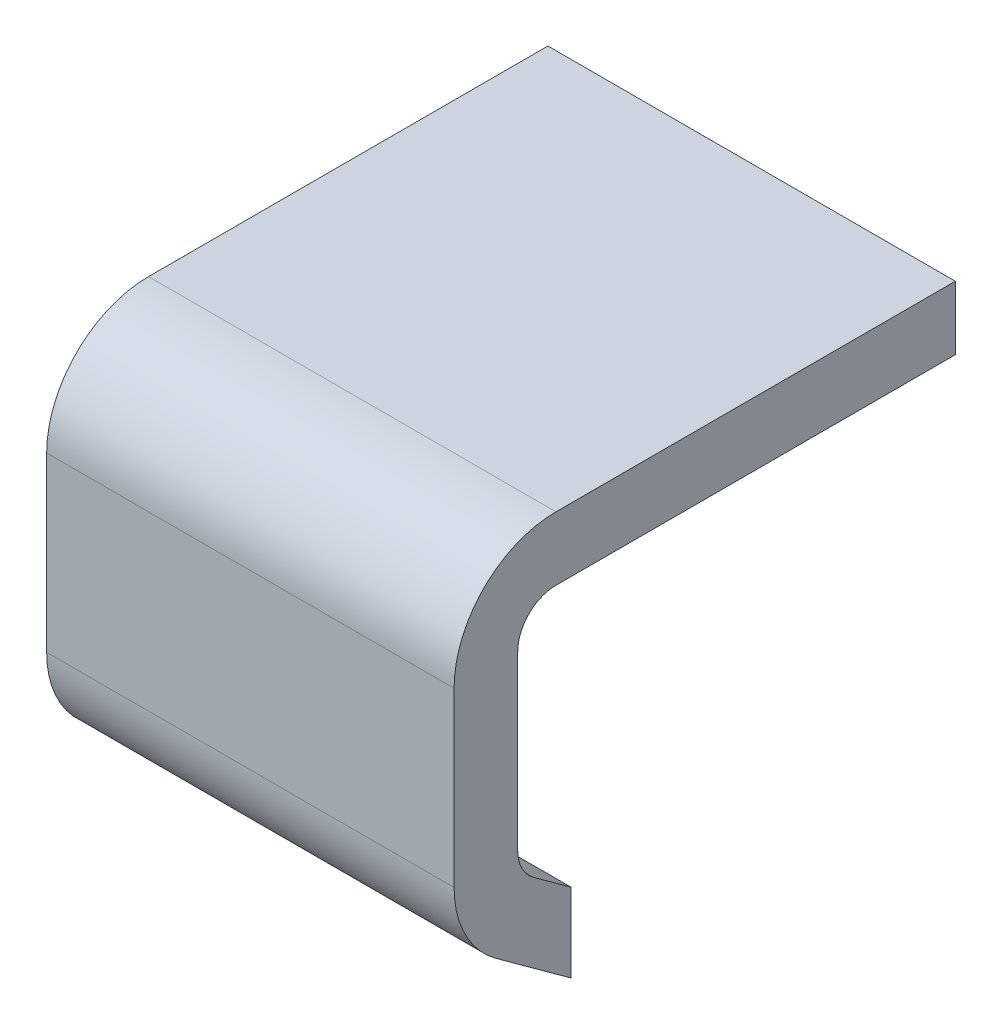
ISO-10303-21;
HEADER;
FILE_DESCRIPTION(('STEP AP214'),'2;1');
FILE_NAME('part.step','',(''),(''),'','','');
FILE_SCHEMA(('AUTOMOTIVE_DESIGN { 1 0 10303 214 1 1 1 1 }'));
ENDSEC;
DATA;
#1=APPLICATION_CONTEXT('core data for automotive mechanical design processes');
#2=APPLICATION_PROTOCOL_DEFINITION('international standard','automotive_design',2000,#1);
#3=PRODUCT_CONTEXT('',#1,'mechanical');
#4=PRODUCT('Part','Part','',(#3));
#5=PRODUCT_RELATED_PRODUCT_CATEGORY('part','',(#4));
#6=PRODUCT_DEFINITION_FORMATION('','',#4);
#7=PRODUCT_DEFINITION_CONTEXT('part definition',#1,'design');
#8=PRODUCT_DEFINITION('design','',#6,#7);
#9=PRODUCT_DEFINITION_SHAPE('','',#8);
#10=(LENGTH_UNIT() NAMED_UNIT(*) SI_UNIT(.MILLI.,.METRE.));
#11=(NAMED_UNIT(*) PLANE_ANGLE_UNIT() SI_UNIT($,.RADIAN.));
#12=(NAMED_UNIT(*) SI_UNIT($,.STERADIAN.) SOLID_ANGLE_UNIT());
#13=UNCERTAINTY_MEASURE_WITH_UNIT(LENGTH_MEASURE(1.E-05),#10,'distance_accuracy_value','');
#14=(GEOMETRIC_REPRESENTATION_CONTEXT(3) GLOBAL_UNCERTAINTY_ASSIGNED_CONTEXT((#13)) GLOBAL_UNIT_ASSIGNED_CONTEXT((#10,
#11,#12)) REPRESENTATION_CONTEXT('',''));
#15=CARTESIAN_POINT('',(0.,0.,0.));
#16=DIRECTION('',(0.,0.,1.));
#17=DIRECTION('',(1.,0.,0.));
#18=AXIS2_PLACEMENT_3D('',#15,#16,#17);
#19=CARTESIAN_POINT('',(0.9652,2.62187788786696,0.20779852546605));
#20=DIRECTION('',(0.,0.,1.));
#21=DIRECTION('',(1.,0.,0.));
#22=AXIS2_PLACEMENT_3D('',#19,#20,#21);
#23=PLANE('',#22);
#24=DIRECTION('',(0.,1.,0.));
#25=VECTOR('',#24,1.);
#26=CARTESIAN_POINT('',(1.3716,2.9337,0.20779852546605));
#27=LINE('',#26,#25);
#28=CARTESIAN_POINT('',(1.3716,2.794,0.207798525466051));
#29=VERTEX_POINT('',#28);
#30=CARTESIAN_POINT('',(1.3716,2.44975577573621,0.207798525466051));
#31=VERTEX_POINT('',#30);
#32=EDGE_CURVE('E185',#29,#31,#27,.F.);
#33=ORIENTED_EDGE('',*,*,#32,.F.);
#34=DIRECTION('',(1.,0.,0.));
#35=VECTOR('',#34,1.);
#36=CARTESIAN_POINT('',(1.39554278568583,2.794,0.207798525466052));
#37=LINE('',#36,#35);
#38=CARTESIAN_POINT('',(0.5588,2.794,0.207798525466051));
#39=VERTEX_POINT('',#38);
#40=EDGE_CURVE('E170',#39,#29,#37,.T.);
#41=ORIENTED_EDGE('',*,*,#40,.F.);
#42=DIRECTION('',(0.,1.,0.));
#43=VECTOR('',#42,1.);
#44=CARTESIAN_POINT('',(0.5588,2.9337,0.20779852546605));
#45=LINE('',#44,#43);
#46=CARTESIAN_POINT('',(0.5588,2.44975577573621,0.207798525466051));
#47=VERTEX_POINT('',#46);
#48=EDGE_CURVE('E101',#39,#47,#45,.F.);
#49=ORIENTED_EDGE('',*,*,#48,.T.);
#50=DIRECTION('',(1.,0.,0.));
#51=VECTOR('',#50,1.);
#52=CARTESIAN_POINT('',(1.39554278568583,2.44975577573621,0.207798525466052));
#53=LINE('',#52,#51);
#54=EDGE_CURVE('E111',#31,#47,#53,.F.);
#55=ORIENTED_EDGE('',*,*,#54,.F.);
#56=EDGE_LOOP('',(#33,#41,#49,#55));
#57=FACE_BOUND('',#56,.T.);
#58=ADVANCED_FACE('F16',(#57),#23,.T.);
#59=CARTESIAN_POINT('',(1.39554278568583,2.44975577573621,0.00459852546605234));
#60=DIRECTION('',(1.,0.,0.));
#61=DIRECTION('',(0.,0.,-1.));
#62=AXIS2_PLACEMENT_3D('',#59,#60,#61);
#63=CYLINDRICAL_SURFACE('',#62,0.2032);
#64=CARTESIAN_POINT('',(1.3716,2.44975577573621,0.00459852546605234));
#65=DIRECTION('',(1.,0.,0.));
#66=DIRECTION('',(0.,0.,-1.));
#67=AXIS2_PLACEMENT_3D('',#64,#65,#66);
#68=CIRCLE('',#67,0.2032);
#69=CARTESIAN_POINT('',(1.3716,2.28536352247927,0.124036488731884));
#70=VERTEX_POINT('',#69);
#71=EDGE_CURVE('E183',#31,#70,#68,.T.);
#72=ORIENTED_EDGE('',*,*,#71,.F.);
#73=ORIENTED_EDGE('',*,*,#54,.T.);
#74=CARTESIAN_POINT('',(0.5588,2.44975577573621,0.00459852546605234));
#75=DIRECTION('',(1.,0.,0.));
#76=DIRECTION('',(0.,0.,-1.));
#77=AXIS2_PLACEMENT_3D('',#74,#75,#76);
#78=CIRCLE('',#77,0.2032);
#79=CARTESIAN_POINT('',(0.5588,2.28536352247928,0.12403648873189));
#80=VERTEX_POINT('',#79);
#81=EDGE_CURVE('E19',#47,#80,#78,.T.);
#82=ORIENTED_EDGE('',*,*,#81,.T.);
#83=DIRECTION('',(1.,0.,0.));
#84=VECTOR('',#83,1.);
#85=CARTESIAN_POINT('',(0.9652,2.28536352247927,0.124036488731813));
#86=LINE('',#85,#84);
#87=EDGE_CURVE('E109',#80,#70,#86,.T.);
#88=ORIENTED_EDGE('',*,*,#87,.T.);
#89=EDGE_LOOP('',(#72,#73,#82,#88));
#90=FACE_BOUND('',#89,.T.);
#91=ADVANCED_FACE('F108',(#90),#63,.T.);
#92=CARTESIAN_POINT('',(0.9652,2.23107754032952,0.0493182443658794));
#93=DIRECTION('',(0.,0.809016994374918,-0.587785252292513));
#94=DIRECTION('',(0.,0.587785252292513,0.809016994374918));
#95=AXIS2_PLACEMENT_3D('',#92,#93,#94);
#96=PLANE('',#95);
#97=ORIENTED_EDGE('',*,*,#87,.F.);
#98=DIRECTION('',(0.,-0.587785252292903,-0.809016994374635));
#99=VECTOR('',#98,1.);
#100=CARTESIAN_POINT('',(0.5588,2.28536352247921,0.12403648873186));
#101=LINE('',#100,#99);
#102=CARTESIAN_POINT('',(0.5588,2.17679155817958,-0.0254000000000169));
#103=VERTEX_POINT('',#102);
#104=EDGE_CURVE('E114',#80,#103,#101,.T.);
#105=ORIENTED_EDGE('',*,*,#104,.T.);
#106=DIRECTION('',(1.,0.,0.));
#107=VECTOR('',#106,1.);
#108=CARTESIAN_POINT('',(0.9652,2.17679155817958,-0.0254));
#109=LINE('',#108,#107);
#110=CARTESIAN_POINT('',(1.3716,2.17679155817958,-0.0254000000000339));
#111=VERTEX_POINT('',#110);
#112=EDGE_CURVE('E121',#103,#111,#109,.T.);
#113=ORIENTED_EDGE('',*,*,#112,.T.);
#114=DIRECTION('',(0.,-0.587785252292837,-0.809016994374683));
#115=VECTOR('',#114,1.);
#116=CARTESIAN_POINT('',(1.3716,2.28536352247921,0.12403648873186));
#117=LINE('',#116,#115);
#118=EDGE_CURVE('E119',#70,#111,#117,.T.);
#119=ORIENTED_EDGE('',*,*,#118,.F.);
#120=EDGE_LOOP('',(#97,#105,#113,#119));
#121=FACE_BOUND('',#120,.T.);
#122=ADVANCED_FACE('F116',(#121),#96,.F.);
#123=CARTESIAN_POINT('',(0.9652,2.25528187475083,-0.0254));
#124=DIRECTION('',(0.,0.,1.));
#125=DIRECTION('',(1.,0.,0.));
#126=AXIS2_PLACEMENT_3D('',#123,#124,#125);
#127=PLANE('',#126);
#128=DIRECTION('',(1.,0.,0.));
#129=VECTOR('',#128,1.);
#130=CARTESIAN_POINT('',(0.9652,2.33377219132205,-0.0253999999999711));
#131=LINE('',#130,#129);
#132=CARTESIAN_POINT('',(1.3716,2.33377219132204,-0.0254000000000242));
#133=VERTEX_POINT('',#132);
#134=CARTESIAN_POINT('',(0.5588,2.33377219132205,-0.0254000000000073));
#135=VERTEX_POINT('',#134);
#136=EDGE_CURVE('E155',#133,#135,#131,.F.);
#137=ORIENTED_EDGE('',*,*,#136,.F.);
#138=DIRECTION('',(0.,1.,0.));
#139=VECTOR('',#138,1.);
#140=CARTESIAN_POINT('',(1.3716,2.9337,-0.0254000000000508));
#141=LINE('',#140,#139);
#142=EDGE_CURVE('E160',#111,#133,#141,.T.);
#143=ORIENTED_EDGE('',*,*,#142,.F.);
#144=ORIENTED_EDGE('',*,*,#112,.F.);
#145=DIRECTION('',(0.,1.,0.));
#146=VECTOR('',#145,1.);
#147=CARTESIAN_POINT('',(0.5588,2.9337,-0.0254000000000254));
#148=LINE('',#147,#146);
#149=EDGE_CURVE('E127',#103,#135,#148,.T.);
#150=ORIENTED_EDGE('',*,*,#149,.T.);
#151=EDGE_LOOP('',(#137,#143,#144,#150));
#152=FACE_BOUND('',#151,.T.);
#153=ADVANCED_FACE('F263',(#152),#127,.F.);
#154=CARTESIAN_POINT('',(0.9652,2.36094043604339,0.0119938808453628));
#155=DIRECTION('',(0.,0.809016994374577,-0.587785252292983));
#156=DIRECTION('',(0.,0.587785252292983,0.809016994374577));
#157=AXIS2_PLACEMENT_3D('',#154,#155,#156);
#158=PLANE('',#157);
#159=DIRECTION('',(0.,0.587785252292175,0.809016994375164));
#160=VECTOR('',#159,1.);
#161=CARTESIAN_POINT('',(1.3716,2.33377219132208,-0.0253999999999873));
#162=LINE('',#161,#160);
#163=CARTESIAN_POINT('',(1.3716,2.38810868076471,0.0493877616907595));
#164=VERTEX_POINT('',#163);
#165=EDGE_CURVE('E163',#133,#164,#162,.T.);
#166=ORIENTED_EDGE('',*,*,#165,.F.);
#167=ORIENTED_EDGE('',*,*,#136,.T.);
#168=DIRECTION('',(0.,0.587785252292436,0.809016994374974));
#169=VECTOR('',#168,1.);
#170=CARTESIAN_POINT('',(0.5588,2.33377219132208,-0.0253999999999873));
#171=LINE('',#170,#169);
#172=CARTESIAN_POINT('',(0.5588,2.38810868076473,0.0493877616907603));
#173=VERTEX_POINT('',#172);
#174=EDGE_CURVE('E129',#135,#173,#171,.T.);
#175=ORIENTED_EDGE('',*,*,#174,.T.);
#176=DIRECTION('',(1.,0.,0.));
#177=VECTOR('',#176,1.);
#178=CARTESIAN_POINT('',(1.39554278568583,2.3881086807647,0.0493877616907273));
#179=LINE('',#178,#177);
#180=EDGE_CURVE('E153',#173,#164,#179,.T.);
#181=ORIENTED_EDGE('',*,*,#180,.T.);
#182=EDGE_LOOP('',(#166,#167,#175,#181));
#183=FACE_BOUND('',#182,.T.);
#184=ADVANCED_FACE('F264',(#183),#158,.T.);
#185=CARTESIAN_POINT('',(1.39554278568583,2.44975577573621,0.00459852546605234));
#186=DIRECTION('',(1.,0.,0.));
#187=DIRECTION('',(0.,0.,-1.));
#188=AXIS2_PLACEMENT_3D('',#185,#186,#187);
#189=CYLINDRICAL_SURFACE('',#188,0.0762000000001016);
#190=ORIENTED_EDGE('',*,*,#180,.F.);
#191=CARTESIAN_POINT('',(0.5588,2.44975577573621,0.00459852546605234));
#192=DIRECTION('',(1.,0.,0.));
#193=DIRECTION('',(0.,0.,-1.));
#194=AXIS2_PLACEMENT_3D('',#191,#192,#193);
#195=CIRCLE('',#194,0.0762000000001016);
#196=CARTESIAN_POINT('',(0.5588,2.44975577573621,0.0807985254660498));
#197=VERTEX_POINT('',#196);
#198=EDGE_CURVE('E194',#173,#197,#195,.F.);
#199=ORIENTED_EDGE('',*,*,#198,.T.);
#200=DIRECTION('',(1.,0.,0.));
#201=VECTOR('',#200,1.);
#202=CARTESIAN_POINT('',(0.9652,2.44975577573621,0.0807985254660498));
#203=LINE('',#202,#201);
#204=CARTESIAN_POINT('',(1.3716,2.44975577573621,0.0807985254661006));
#205=VERTEX_POINT('',#204);
#206=EDGE_CURVE('E151',#197,#205,#203,.T.);
#207=ORIENTED_EDGE('',*,*,#206,.T.);
#208=CARTESIAN_POINT('',(1.3716,2.44975577573621,0.00459852546605234));
#209=DIRECTION('',(1.,0.,0.));
#210=DIRECTION('',(0.,0.,-1.));
#211=AXIS2_PLACEMENT_3D('',#208,#209,#210);
#212=CIRCLE('',#211,0.0762000000001016);
#213=EDGE_CURVE('E180',#164,#205,#212,.F.);
#214=ORIENTED_EDGE('',*,*,#213,.F.);
#215=EDGE_LOOP('',(#190,#199,#207,#214));
#216=FACE_BOUND('',#215,.T.);
#217=ADVANCED_FACE('F265',(#216),#189,.F.);
#218=CARTESIAN_POINT('',(0.9652,2.62187788786696,0.0807985254660498));
#219=DIRECTION('',(0.,0.,1.));
#220=DIRECTION('',(1.,0.,0.));
#221=AXIS2_PLACEMENT_3D('',#218,#219,#220);
#222=PLANE('',#221);
#223=ORIENTED_EDGE('',*,*,#206,.F.);
#224=DIRECTION('',(0.,1.,0.));
#225=VECTOR('',#224,1.);
#226=CARTESIAN_POINT('',(0.5588,2.9337,0.0807985254660498));
#227=LINE('',#226,#225);
#228=CARTESIAN_POINT('',(0.5588,2.794,0.0807985254660511));
#229=VERTEX_POINT('',#228);
#230=EDGE_CURVE('E193',#197,#229,#227,.T.);
#231=ORIENTED_EDGE('',*,*,#230,.T.);
#232=DIRECTION('',(1.,0.,0.));
#233=VECTOR('',#232,1.);
#234=CARTESIAN_POINT('',(1.39554278568583,2.794,0.0807985254660523));
#235=LINE('',#234,#233);
#236=CARTESIAN_POINT('',(1.3716,2.794,0.0807985254661019));
#237=VERTEX_POINT('',#236);
#238=EDGE_CURVE('E149',#229,#237,#235,.T.);
#239=ORIENTED_EDGE('',*,*,#238,.T.);
#240=DIRECTION('',(0.,1.,0.));
#241=VECTOR('',#240,1.);
#242=CARTESIAN_POINT('',(1.3716,2.9337,0.0807985254661514));
#243=LINE('',#242,#241);
#244=EDGE_CURVE('E179',#205,#237,#243,.T.);
#245=ORIENTED_EDGE('',*,*,#244,.F.);
#246=EDGE_LOOP('',(#223,#231,#239,#245));
#247=FACE_BOUND('',#246,.T.);
#248=ADVANCED_FACE('F239',(#247),#222,.F.);
#249=CARTESIAN_POINT('',(1.39554278568583,2.794,0.00459852546605234));
#250=DIRECTION('',(1.,0.,0.));
#251=DIRECTION('',(0.,0.,-1.));
#252=AXIS2_PLACEMENT_3D('',#249,#250,#251);
#253=CYLINDRICAL_SURFACE('',#252,0.0762);
#254=ORIENTED_EDGE('',*,*,#238,.F.);
#255=CARTESIAN_POINT('',(0.5588,2.794,0.00459852546605234));
#256=DIRECTION('',(1.,0.,0.));
#257=DIRECTION('',(0.,0.,-1.));
#258=AXIS2_PLACEMENT_3D('',#255,#256,#257);
#259=CIRCLE('',#258,0.0762);
#260=CARTESIAN_POINT('',(0.5588,2.8702,0.00459852546605233));
#261=VERTEX_POINT('',#260);
#262=EDGE_CURVE('E192',#229,#261,#259,.F.);
#263=ORIENTED_EDGE('',*,*,#262,.T.);
#264=DIRECTION('',(1.,0.,0.));
#265=VECTOR('',#264,1.);
#266=CARTESIAN_POINT('',(0.9652,2.8702,0.00459852546605232));
#267=LINE('',#266,#265);
#268=CARTESIAN_POINT('',(1.3716,2.8702,0.00459852546605233));
#269=VERTEX_POINT('',#268);
#270=EDGE_CURVE('E138',#261,#269,#267,.T.);
#271=ORIENTED_EDGE('',*,*,#270,.T.);
#272=CARTESIAN_POINT('',(1.3716,2.794,0.00459852546605234));
#273=DIRECTION('',(1.,0.,0.));
#274=DIRECTION('',(0.,0.,-1.));
#275=AXIS2_PLACEMENT_3D('',#272,#273,#274);
#276=CIRCLE('',#275,0.0762);
#277=EDGE_CURVE('E146',#237,#269,#276,.F.);
#278=ORIENTED_EDGE('',*,*,#277,.F.);
#279=EDGE_LOOP('',(#254,#263,#271,#278));
#280=FACE_BOUND('',#279,.T.);
#281=ADVANCED_FACE('F244',(#280),#253,.F.);
#282=CARTESIAN_POINT('',(0.9652,2.8702,-0.393800120335954));
#283=DIRECTION('',(0.,1.,0.));
#284=DIRECTION('',(0.,0.,1.));
#285=AXIS2_PLACEMENT_3D('',#282,#283,#284);
#286=PLANE('',#285);
#287=DIRECTION('',(0.,0.,-1.));
#288=VECTOR('',#287,1.);
#289=CARTESIAN_POINT('',(0.5588,2.8702,-0.45032746613778));
#290=LINE('',#289,#288);
#291=CARTESIAN_POINT('',(0.5588,2.8702,-0.79219876613778));
#292=VERTEX_POINT('',#291);
#293=EDGE_CURVE('E191',#261,#292,#290,.T.);
#294=ORIENTED_EDGE('',*,*,#293,.T.);
#295=DIRECTION('',(1.,0.,0.));
#296=VECTOR('',#295,1.);
#297=CARTESIAN_POINT('',(0.9652,2.8702,-0.79219876613778));
#298=LINE('',#297,#296);
#299=CARTESIAN_POINT('',(1.3716,2.8702,-0.79219876613778));
#300=VERTEX_POINT('',#299);
#301=EDGE_CURVE('E144',#292,#300,#298,.T.);
#302=ORIENTED_EDGE('',*,*,#301,.T.);
#303=DIRECTION('',(0.,0.,-1.));
#304=VECTOR('',#303,1.);
#305=CARTESIAN_POINT('',(1.3716,2.8702,-0.393800120335954));
#306=LINE('',#305,#304);
#307=EDGE_CURVE('E172',#269,#300,#306,.T.);
#308=ORIENTED_EDGE('',*,*,#307,.F.);
#309=ORIENTED_EDGE('',*,*,#270,.F.);
#310=EDGE_LOOP('',(#294,#302,#308,#309));
#311=FACE_BOUND('',#310,.T.);
#312=ADVANCED_FACE('F249',(#311),#286,.F.);
#313=CARTESIAN_POINT('',(0.5588,2.9337,-0.45032746613778));
#314=DIRECTION('',(1.,0.,0.));
#315=DIRECTION('',(0.,0.,-1.));
#316=AXIS2_PLACEMENT_3D('',#313,#314,#315);
#317=PLANE('',#316);
#318=DIRECTION('',(0.,1.,0.));
#319=VECTOR('',#318,1.);
#320=CARTESIAN_POINT('',(0.5588,2.9337,-0.79219876613778));
#321=LINE('',#320,#319);
#322=CARTESIAN_POINT('',(0.5588,2.9972,-0.79219876613778));
#323=VERTEX_POINT('',#322);
#324=EDGE_CURVE('E139',#323,#292,#321,.F.);
#325=ORIENTED_EDGE('',*,*,#324,.T.);
#326=ORIENTED_EDGE('',*,*,#293,.F.);
#327=ORIENTED_EDGE('',*,*,#262,.F.);
#328=ORIENTED_EDGE('',*,*,#230,.F.);
#329=ORIENTED_EDGE('',*,*,#198,.F.);
#330=ORIENTED_EDGE('',*,*,#174,.F.);
#331=ORIENTED_EDGE('',*,*,#149,.F.);
#332=ORIENTED_EDGE('',*,*,#104,.F.);
#333=ORIENTED_EDGE('',*,*,#81,.F.);
#334=ORIENTED_EDGE('',*,*,#48,.F.);
#335=CARTESIAN_POINT('',(0.5588,2.794,0.00459852546605234));
#336=DIRECTION('',(1.,0.,0.));
#337=DIRECTION('',(0.,0.,-1.));
#338=AXIS2_PLACEMENT_3D('',#335,#336,#337);
#339=CIRCLE('',#338,0.2032);
#340=CARTESIAN_POINT('',(0.5588,2.9972,0.0045985254660536));
#341=VERTEX_POINT('',#340);
#342=EDGE_CURVE('E173',#341,#39,#339,.T.);
#343=ORIENTED_EDGE('',*,*,#342,.F.);
#344=DIRECTION('',(0.,0.,1.));
#345=VECTOR('',#344,1.);
#346=CARTESIAN_POINT('',(0.5588,2.9972,-0.393800120335954));
#347=LINE('',#346,#345);
#348=EDGE_CURVE('E141',#323,#341,#347,.T.);
#349=ORIENTED_EDGE('',*,*,#348,.F.);
#350=EDGE_LOOP('',(#325,#326,#327,#328,#329,#330,#331,#332,#333,#334,#343,#349));
#351=FACE_BOUND('',#350,.T.);
#352=ADVANCED_FACE('F125',(#351),#317,.F.);
#353=CARTESIAN_POINT('',(1.39554278568583,2.794,0.00459852546605234));
#354=DIRECTION('',(1.,0.,0.));
#355=DIRECTION('',(0.,0.,-1.));
#356=AXIS2_PLACEMENT_3D('',#353,#354,#355);
#357=CYLINDRICAL_SURFACE('',#356,0.2032);
#358=CARTESIAN_POINT('',(1.3716,2.794,0.00459852546605234));
#359=DIRECTION('',(1.,0.,0.));
#360=DIRECTION('',(0.,0.,-1.));
#361=AXIS2_PLACEMENT_3D('',#358,#359,#360);
#362=CIRCLE('',#361,0.2032);
#363=CARTESIAN_POINT('',(1.3716,2.9972,0.0045985254660536));
#364=VERTEX_POINT('',#363);
#365=EDGE_CURVE('E186',#364,#29,#362,.T.);
#366=ORIENTED_EDGE('',*,*,#365,.F.);
#367=DIRECTION('',(1.,0.,0.));
#368=VECTOR('',#367,1.);
#369=CARTESIAN_POINT('',(0.9652,2.9972,0.00459852546605486));
#370=LINE('',#369,#368);
#371=EDGE_CURVE('E209',#341,#364,#370,.T.);
#372=ORIENTED_EDGE('',*,*,#371,.F.);
#373=ORIENTED_EDGE('',*,*,#342,.T.);
#374=ORIENTED_EDGE('',*,*,#40,.T.);
#375=EDGE_LOOP('',(#366,#372,#373,#374));
#376=FACE_BOUND('',#375,.T.);
#377=ADVANCED_FACE('F259',(#376),#357,.T.);
#378=CARTESIAN_POINT('',(1.3716,2.9337,-0.393800120335954));
#379=DIRECTION('',(1.,0.,0.));
#380=DIRECTION('',(0.,0.,-1.));
#381=AXIS2_PLACEMENT_3D('',#378,#379,#380);
#382=PLANE('',#381);
#383=ORIENTED_EDGE('',*,*,#244,.T.);
#384=ORIENTED_EDGE('',*,*,#277,.T.);
#385=ORIENTED_EDGE('',*,*,#307,.T.);
#386=DIRECTION('',(0.,1.,0.));
#387=VECTOR('',#386,1.);
#388=CARTESIAN_POINT('',(1.3716,2.9337,-0.79219876613778));
#389=LINE('',#388,#387);
#390=CARTESIAN_POINT('',(1.3716,2.9972,-0.79219876613778));
#391=VERTEX_POINT('',#390);
#392=EDGE_CURVE('E34',#300,#391,#389,.T.);
#393=ORIENTED_EDGE('',*,*,#392,.T.);
#394=DIRECTION('',(0.,0.,1.));
#395=VECTOR('',#394,1.);
#396=CARTESIAN_POINT('',(1.3716,2.9972,-0.393800120335954));
#397=LINE('',#396,#395);
#398=EDGE_CURVE('E25',#364,#391,#397,.F.);
#399=ORIENTED_EDGE('',*,*,#398,.F.);
#400=ORIENTED_EDGE('',*,*,#365,.T.);
#401=ORIENTED_EDGE('',*,*,#32,.T.);
#402=ORIENTED_EDGE('',*,*,#71,.T.);
#403=ORIENTED_EDGE('',*,*,#118,.T.);
#404=ORIENTED_EDGE('',*,*,#142,.T.);
#405=ORIENTED_EDGE('',*,*,#165,.T.);
#406=ORIENTED_EDGE('',*,*,#213,.T.);
#407=EDGE_LOOP('',(#383,#384,#385,#393,#399,#400,#401,#402,#403,#404,#405,#406));
#408=FACE_BOUND('',#407,.T.);
#409=ADVANCED_FACE('F235',(#408),#382,.T.);
#410=CARTESIAN_POINT('',(0.9652,2.9337,-0.79219876613778));
#411=DIRECTION('',(0.,0.,1.));
#412=DIRECTION('',(1.,0.,0.));
#413=AXIS2_PLACEMENT_3D('',#410,#411,#412);
#414=PLANE('',#413);
#415=DIRECTION('',(1.,0.,0.));
#416=VECTOR('',#415,1.);
#417=CARTESIAN_POINT('',(0.9652,2.9972,-0.79219876613778));
#418=LINE('',#417,#416);
#419=EDGE_CURVE('E11',#391,#323,#418,.F.);
#420=ORIENTED_EDGE('',*,*,#419,.F.);
#421=ORIENTED_EDGE('',*,*,#392,.F.);
#422=ORIENTED_EDGE('',*,*,#301,.F.);
#423=ORIENTED_EDGE('',*,*,#324,.F.);
#424=EDGE_LOOP('',(#420,#421,#422,#423));
#425=FACE_BOUND('',#424,.T.);
#426=ADVANCED_FACE('F252',(#425),#414,.F.);
#427=CARTESIAN_POINT('',(0.9652,2.9972,-0.393800120335954));
#428=DIRECTION('',(0.,1.,0.));
#429=DIRECTION('',(0.,0.,1.));
#430=AXIS2_PLACEMENT_3D('',#427,#428,#429);
#431=PLANE('',#430);
#432=ORIENTED_EDGE('',*,*,#398,.T.);
#433=ORIENTED_EDGE('',*,*,#419,.T.);
#434=ORIENTED_EDGE('',*,*,#348,.T.);
#435=ORIENTED_EDGE('',*,*,#371,.T.);
#436=EDGE_LOOP('',(#432,#433,#434,#435));
#437=FACE_BOUND('',#436,.T.);
#438=ADVANCED_FACE('F255',(#437),#431,.T.);
#439=CLOSED_SHELL('',(#58,#91,#122,#153,#184,#217,#248,#281,#312,#352,#377,#409,#426,#438));
#440=MANIFOLD_SOLID_BREP('B1',#439);
#441=ADVANCED_BREP_SHAPE_REPRESENTATION('',(#18,#440),#14);
#442=SHAPE_DEFINITION_REPRESENTATION(#9,#441);
ENDSEC;
END-ISO-10303-21;
